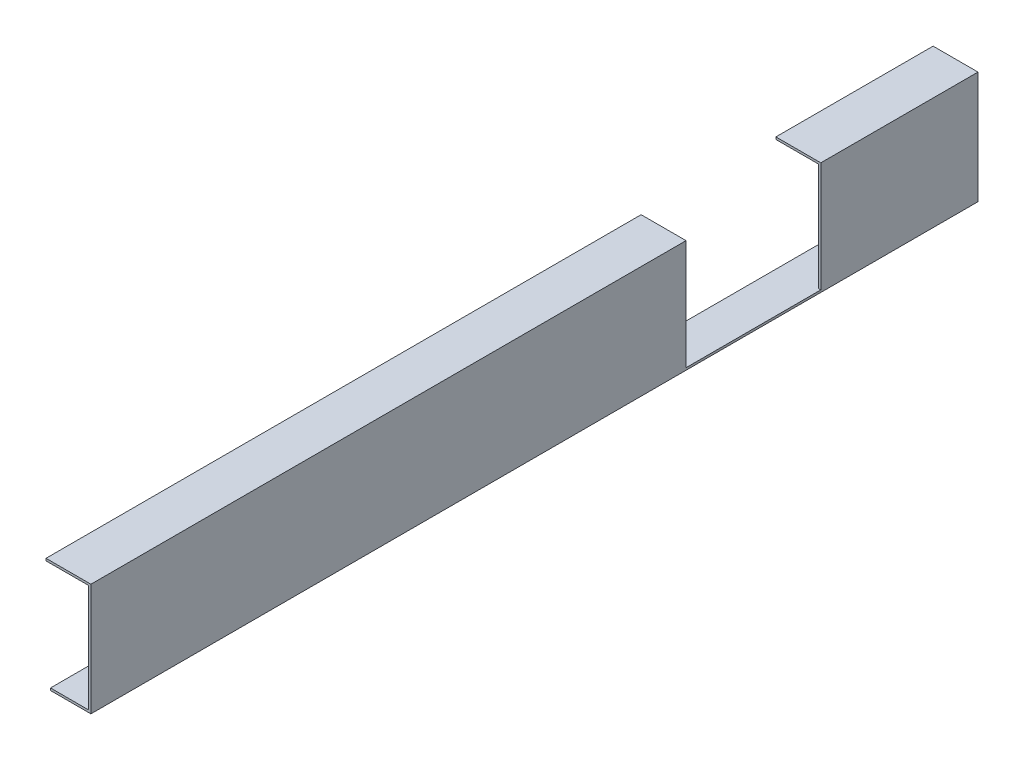
ISO-10303-21;
HEADER;
FILE_DESCRIPTION(('STEP AP214'),'2;1');
FILE_NAME('part.step','',(''),(''),'','','');
FILE_SCHEMA(('AUTOMOTIVE_DESIGN { 1 0 10303 214 1 1 1 1 }'));
ENDSEC;
DATA;
#1=APPLICATION_CONTEXT('core data for automotive mechanical design processes');
#2=APPLICATION_PROTOCOL_DEFINITION('international standard','automotive_design',2000,#1);
#3=PRODUCT_CONTEXT('',#1,'mechanical');
#4=PRODUCT('Part','Part','',(#3));
#5=PRODUCT_RELATED_PRODUCT_CATEGORY('part','',(#4));
#6=PRODUCT_DEFINITION_FORMATION('','',#4);
#7=PRODUCT_DEFINITION_CONTEXT('part definition',#1,'design');
#8=PRODUCT_DEFINITION('design','',#6,#7);
#9=PRODUCT_DEFINITION_SHAPE('','',#8);
#10=(LENGTH_UNIT() NAMED_UNIT(*) SI_UNIT(.MILLI.,.METRE.));
#11=(NAMED_UNIT(*) PLANE_ANGLE_UNIT() SI_UNIT($,.RADIAN.));
#12=(NAMED_UNIT(*) SI_UNIT($,.STERADIAN.) SOLID_ANGLE_UNIT());
#13=UNCERTAINTY_MEASURE_WITH_UNIT(LENGTH_MEASURE(1.E-05),#10,'distance_accuracy_value','');
#14=(GEOMETRIC_REPRESENTATION_CONTEXT(3) GLOBAL_UNCERTAINTY_ASSIGNED_CONTEXT((#13)) GLOBAL_UNIT_ASSIGNED_CONTEXT((#10,
#11,#12)) REPRESENTATION_CONTEXT('',''));
#15=CARTESIAN_POINT('',(0.,0.,0.));
#16=DIRECTION('',(0.,0.,1.));
#17=DIRECTION('',(1.,0.,0.));
#18=AXIS2_PLACEMENT_3D('',#15,#16,#17);
#19=CARTESIAN_POINT('',(-4.00000000000001,44.6666666666667,790.));
#20=DIRECTION('',(1.,0.,0.));
#21=DIRECTION('',(0.,0.,-1.));
#22=AXIS2_PLACEMENT_3D('',#19,#20,#21);
#23=PLANE('',#22);
#24=DIRECTION('',(0.,0.,-1.));
#25=VECTOR('',#24,1.);
#26=CARTESIAN_POINT('',(-4.00000000000001,46.6666666666667,790.));
#27=LINE('',#26,#25);
#28=CARTESIAN_POINT('',(-4.00000000000001,46.6666666666667,790.));
#29=VERTEX_POINT('',#28);
#30=CARTESIAN_POINT('',(-4.,46.6666666666667,260.));
#31=VERTEX_POINT('',#30);
#32=EDGE_CURVE('E171',#29,#31,#27,.T.);
#33=ORIENTED_EDGE('',*,*,#32,.T.);
#34=DIRECTION('',(0.,-1.,0.));
#35=VECTOR('',#34,1.);
#36=CARTESIAN_POINT('',(-4.00000000000001,44.6666666666667,260.));
#37=LINE('',#36,#35);
#38=CARTESIAN_POINT('',(-4.,44.6666666666667,260.));
#39=VERTEX_POINT('',#38);
#40=EDGE_CURVE('E154',#31,#39,#37,.T.);
#41=ORIENTED_EDGE('',*,*,#40,.T.);
#42=DIRECTION('',(0.,0.,-1.));
#43=VECTOR('',#42,1.);
#44=CARTESIAN_POINT('',(-4.00000000000001,44.6666666666667,790.));
#45=LINE('',#44,#43);
#46=CARTESIAN_POINT('',(-4.00000000000001,44.6666666666667,790.));
#47=VERTEX_POINT('',#46);
#48=EDGE_CURVE('E188',#47,#39,#45,.T.);
#49=ORIENTED_EDGE('',*,*,#48,.F.);
#50=DIRECTION('',(0.,-1.,0.));
#51=VECTOR('',#50,1.);
#52=CARTESIAN_POINT('',(-4.00000000000001,44.6666666666667,790.));
#53=LINE('',#52,#51);
#54=EDGE_CURVE('E170',#29,#47,#53,.T.);
#55=ORIENTED_EDGE('',*,*,#54,.F.);
#56=EDGE_LOOP('',(#33,#41,#49,#55));
#57=FACE_BOUND('',#56,.T.);
#58=ADVANCED_FACE('F38',(#57),#23,.F.);
#59=CARTESIAN_POINT('',(34.,44.6666666666667,790.));
#60=DIRECTION('',(0.,1.,0.));
#61=DIRECTION('',(0.,0.,1.));
#62=AXIS2_PLACEMENT_3D('',#59,#60,#61);
#63=PLANE('',#62);
#64=ORIENTED_EDGE('',*,*,#48,.T.);
#65=DIRECTION('',(1.,0.,0.));
#66=VECTOR('',#65,1.);
#67=CARTESIAN_POINT('',(34.,44.6666666666667,260.));
#68=LINE('',#67,#66);
#69=CARTESIAN_POINT('',(34.,44.6666666666667,260.));
#70=VERTEX_POINT('',#69);
#71=EDGE_CURVE('E225',#39,#70,#68,.T.);
#72=ORIENTED_EDGE('',*,*,#71,.T.);
#73=DIRECTION('',(0.,0.,-1.));
#74=VECTOR('',#73,1.);
#75=CARTESIAN_POINT('',(34.,44.6666666666667,790.));
#76=LINE('',#75,#74);
#77=CARTESIAN_POINT('',(34.,44.6666666666667,790.));
#78=VERTEX_POINT('',#77);
#79=EDGE_CURVE('E184',#78,#70,#76,.T.);
#80=ORIENTED_EDGE('',*,*,#79,.F.);
#81=DIRECTION('',(1.,0.,0.));
#82=VECTOR('',#81,1.);
#83=CARTESIAN_POINT('',(34.,44.6666666666667,790.));
#84=LINE('',#83,#82);
#85=EDGE_CURVE('E105',#47,#78,#84,.T.);
#86=ORIENTED_EDGE('',*,*,#85,.F.);
#87=EDGE_LOOP('',(#64,#72,#80,#86));
#88=FACE_BOUND('',#87,.T.);
#89=ADVANCED_FACE('F279',(#88),#63,.F.);
#90=CARTESIAN_POINT('',(34.,-51.3333333333333,790.));
#91=DIRECTION('',(1.,0.,0.));
#92=DIRECTION('',(0.,1.,0.));
#93=AXIS2_PLACEMENT_3D('',#90,#91,#92);
#94=PLANE('',#93);
#95=ORIENTED_EDGE('',*,*,#79,.T.);
#96=DIRECTION('',(0.,-1.,0.));
#97=VECTOR('',#96,1.);
#98=CARTESIAN_POINT('',(34.,-51.3333333333333,260.));
#99=LINE('',#98,#97);
#100=CARTESIAN_POINT('',(34.,-51.3333333333333,260.));
#101=VERTEX_POINT('',#100);
#102=EDGE_CURVE('E217',#70,#101,#99,.T.);
#103=ORIENTED_EDGE('',*,*,#102,.T.);
#104=DIRECTION('',(0.,0.,-1.));
#105=VECTOR('',#104,1.);
#106=CARTESIAN_POINT('',(34.,-51.3333333333333,790.));
#107=LINE('',#106,#105);
#108=CARTESIAN_POINT('',(34.,-51.3333333333333,790.));
#109=VERTEX_POINT('',#108);
#110=EDGE_CURVE('E180',#109,#101,#107,.T.);
#111=ORIENTED_EDGE('',*,*,#110,.F.);
#112=DIRECTION('',(0.,-1.,0.));
#113=VECTOR('',#112,1.);
#114=CARTESIAN_POINT('',(34.,-51.3333333333333,790.));
#115=LINE('',#114,#113);
#116=EDGE_CURVE('E232',#78,#109,#115,.T.);
#117=ORIENTED_EDGE('',*,*,#116,.F.);
#118=EDGE_LOOP('',(#95,#103,#111,#117));
#119=FACE_BOUND('',#118,.T.);
#120=ADVANCED_FACE('F283',(#119),#94,.F.);
#121=CARTESIAN_POINT('',(-4.00000000000001,46.6666666666667,790.));
#122=DIRECTION('',(0.,-1.,0.));
#123=DIRECTION('',(0.,0.,-1.));
#124=AXIS2_PLACEMENT_3D('',#121,#122,#123);
#125=PLANE('',#124);
#126=DIRECTION('',(0.,0.,-1.));
#127=VECTOR('',#126,1.);
#128=CARTESIAN_POINT('',(36.,46.6666666666667,790.));
#129=LINE('',#128,#127);
#130=CARTESIAN_POINT('',(36.,46.6666666666667,790.));
#131=VERTEX_POINT('',#130);
#132=CARTESIAN_POINT('',(36.,46.6666666666667,260.));
#133=VERTEX_POINT('',#132);
#134=EDGE_CURVE('E141',#131,#133,#129,.T.);
#135=ORIENTED_EDGE('',*,*,#134,.T.);
#136=DIRECTION('',(-1.,0.,0.));
#137=VECTOR('',#136,1.);
#138=CARTESIAN_POINT('',(-4.00000000000001,46.6666666666667,260.));
#139=LINE('',#138,#137);
#140=EDGE_CURVE('E11',#133,#31,#139,.T.);
#141=ORIENTED_EDGE('',*,*,#140,.T.);
#142=ORIENTED_EDGE('',*,*,#32,.F.);
#143=DIRECTION('',(-1.,0.,0.));
#144=VECTOR('',#143,1.);
#145=CARTESIAN_POINT('',(-4.00000000000001,46.6666666666667,790.));
#146=LINE('',#145,#144);
#147=EDGE_CURVE('E62',#131,#29,#146,.T.);
#148=ORIENTED_EDGE('',*,*,#147,.F.);
#149=EDGE_LOOP('',(#135,#141,#142,#148));
#150=FACE_BOUND('',#149,.T.);
#151=ADVANCED_FACE('F275',(#150),#125,.F.);
#152=CARTESIAN_POINT('',(-4.,44.6666666666667,140.));
#153=VERTEX_POINT('',#152);
#154=CARTESIAN_POINT('',(-4.00000000000001,44.6666666666667,0.));
#155=VERTEX_POINT('',#154);
#156=EDGE_CURVE('E187',#153,#155,#45,.T.);
#157=ORIENTED_EDGE('',*,*,#156,.F.);
#158=DIRECTION('',(0.,1.,0.));
#159=VECTOR('',#158,1.);
#160=CARTESIAN_POINT('',(-4.00000000000001,44.6666666666669,140.));
#161=LINE('',#160,#159);
#162=CARTESIAN_POINT('',(-4.,46.6666666666667,140.));
#163=VERTEX_POINT('',#162);
#164=EDGE_CURVE('E203',#153,#163,#161,.T.);
#165=ORIENTED_EDGE('',*,*,#164,.T.);
#166=CARTESIAN_POINT('',(-4.00000000000001,46.6666666666667,0.));
#167=VERTEX_POINT('',#166);
#168=EDGE_CURVE('E96',#163,#167,#27,.T.);
#169=ORIENTED_EDGE('',*,*,#168,.T.);
#170=DIRECTION('',(0.,-1.,0.));
#171=VECTOR('',#170,1.);
#172=CARTESIAN_POINT('',(-4.00000000000001,44.6666666666667,0.));
#173=LINE('',#172,#171);
#174=EDGE_CURVE('E151',#167,#155,#173,.T.);
#175=ORIENTED_EDGE('',*,*,#174,.T.);
#176=EDGE_LOOP('',(#157,#165,#169,#175));
#177=FACE_BOUND('',#176,.T.);
#178=ADVANCED_FACE('F40',(#177),#23,.F.);
#179=CARTESIAN_POINT('',(34.,44.6666666666667,140.));
#180=VERTEX_POINT('',#179);
#181=CARTESIAN_POINT('',(34.,44.6666666666667,0.));
#182=VERTEX_POINT('',#181);
#183=EDGE_CURVE('E183',#180,#182,#76,.T.);
#184=ORIENTED_EDGE('',*,*,#183,.F.);
#185=DIRECTION('',(-1.,0.,0.));
#186=VECTOR('',#185,1.);
#187=CARTESIAN_POINT('',(34.,44.6666666666667,140.));
#188=LINE('',#187,#186);
#189=EDGE_CURVE('E212',#180,#153,#188,.T.);
#190=ORIENTED_EDGE('',*,*,#189,.T.);
#191=ORIENTED_EDGE('',*,*,#156,.T.);
#192=DIRECTION('',(1.,0.,0.));
#193=VECTOR('',#192,1.);
#194=CARTESIAN_POINT('',(34.,44.6666666666667,0.));
#195=LINE('',#194,#193);
#196=EDGE_CURVE('E153',#155,#182,#195,.T.);
#197=ORIENTED_EDGE('',*,*,#196,.T.);
#198=EDGE_LOOP('',(#184,#190,#191,#197));
#199=FACE_BOUND('',#198,.T.);
#200=ADVANCED_FACE('F210',(#199),#63,.F.);
#201=CARTESIAN_POINT('',(34.,-51.3333333333333,140.));
#202=VERTEX_POINT('',#201);
#203=CARTESIAN_POINT('',(34.,-51.3333333333333,0.));
#204=VERTEX_POINT('',#203);
#205=EDGE_CURVE('E179',#202,#204,#107,.T.);
#206=ORIENTED_EDGE('',*,*,#205,.F.);
#207=DIRECTION('',(0.,1.,0.));
#208=VECTOR('',#207,1.);
#209=CARTESIAN_POINT('',(34.,-51.3333333333331,140.));
#210=LINE('',#209,#208);
#211=EDGE_CURVE('E215',#202,#180,#210,.T.);
#212=ORIENTED_EDGE('',*,*,#211,.T.);
#213=ORIENTED_EDGE('',*,*,#183,.T.);
#214=DIRECTION('',(0.,-1.,0.));
#215=VECTOR('',#214,1.);
#216=CARTESIAN_POINT('',(34.,-51.3333333333333,0.));
#217=LINE('',#216,#215);
#218=EDGE_CURVE('E157',#182,#204,#217,.T.);
#219=ORIENTED_EDGE('',*,*,#218,.T.);
#220=EDGE_LOOP('',(#206,#212,#213,#219));
#221=FACE_BOUND('',#220,.T.);
#222=ADVANCED_FACE('F247',(#221),#94,.F.);
#223=CARTESIAN_POINT('',(0.,-51.3333333333333,790.));
#224=DIRECTION('',(0.,-1.,0.));
#225=DIRECTION('',(0.,0.,-1.));
#226=AXIS2_PLACEMENT_3D('',#223,#224,#225);
#227=PLANE('',#226);
#228=DIRECTION('',(-1.,0.,0.));
#229=VECTOR('',#228,1.);
#230=CARTESIAN_POINT('',(0.,-51.3333333333333,0.));
#231=LINE('',#230,#229);
#232=CARTESIAN_POINT('',(0.,-51.3333333333333,0.));
#233=VERTEX_POINT('',#232);
#234=EDGE_CURVE('E160',#204,#233,#231,.T.);
#235=ORIENTED_EDGE('',*,*,#234,.T.);
#236=DIRECTION('',(0.,0.,-1.));
#237=VECTOR('',#236,1.);
#238=CARTESIAN_POINT('',(0.,-51.3333333333333,790.));
#239=LINE('',#238,#237);
#240=CARTESIAN_POINT('',(0.,-51.3333333333333,790.));
#241=VERTEX_POINT('',#240);
#242=EDGE_CURVE('E177',#241,#233,#239,.T.);
#243=ORIENTED_EDGE('',*,*,#242,.F.);
#244=DIRECTION('',(-1.,0.,0.));
#245=VECTOR('',#244,1.);
#246=CARTESIAN_POINT('',(0.,-51.3333333333333,790.));
#247=LINE('',#246,#245);
#248=EDGE_CURVE('E234',#109,#241,#247,.T.);
#249=ORIENTED_EDGE('',*,*,#248,.F.);
#250=ORIENTED_EDGE('',*,*,#110,.T.);
#251=DIRECTION('',(1.,0.,0.));
#252=VECTOR('',#251,1.);
#253=CARTESIAN_POINT('',(-188.,-51.3333333333333,260.));
#254=LINE('',#253,#252);
#255=CARTESIAN_POINT('',(36.,-51.3333333333333,260.));
#256=VERTEX_POINT('',#255);
#257=EDGE_CURVE('E257',#101,#256,#254,.T.);
#258=ORIENTED_EDGE('',*,*,#257,.T.);
#259=DIRECTION('',(0.,0.,-1.));
#260=VECTOR('',#259,1.);
#261=CARTESIAN_POINT('',(36.,-51.3333333333333,260.));
#262=LINE('',#261,#260);
#263=CARTESIAN_POINT('',(36.,-51.3333333333333,140.));
#264=VERTEX_POINT('',#263);
#265=EDGE_CURVE('E256',#256,#264,#262,.T.);
#266=ORIENTED_EDGE('',*,*,#265,.T.);
#267=DIRECTION('',(1.,0.,0.));
#268=VECTOR('',#267,1.);
#269=CARTESIAN_POINT('',(-188.,-51.3333333333333,140.));
#270=LINE('',#269,#268);
#271=EDGE_CURVE('E219',#202,#264,#270,.T.);
#272=ORIENTED_EDGE('',*,*,#271,.F.);
#273=ORIENTED_EDGE('',*,*,#205,.T.);
#274=EDGE_LOOP('',(#235,#243,#249,#250,#258,#266,#272,#273));
#275=FACE_BOUND('',#274,.T.);
#276=ADVANCED_FACE('F240',(#275),#227,.F.);
#277=CARTESIAN_POINT('',(0.,-53.3333333333333,790.));
#278=DIRECTION('',(1.,0.,0.));
#279=DIRECTION('',(0.,1.,0.));
#280=AXIS2_PLACEMENT_3D('',#277,#278,#279);
#281=PLANE('',#280);
#282=DIRECTION('',(0.,-1.,0.));
#283=VECTOR('',#282,1.);
#284=CARTESIAN_POINT('',(0.,-53.3333333333333,0.));
#285=LINE('',#284,#283);
#286=CARTESIAN_POINT('',(0.,-53.3333333333333,0.));
#287=VERTEX_POINT('',#286);
#288=EDGE_CURVE('E163',#233,#287,#285,.T.);
#289=ORIENTED_EDGE('',*,*,#288,.T.);
#290=DIRECTION('',(0.,0.,-1.));
#291=VECTOR('',#290,1.);
#292=CARTESIAN_POINT('',(0.,-53.3333333333333,790.));
#293=LINE('',#292,#291);
#294=CARTESIAN_POINT('',(0.,-53.3333333333333,790.));
#295=VERTEX_POINT('',#294);
#296=EDGE_CURVE('E140',#295,#287,#293,.T.);
#297=ORIENTED_EDGE('',*,*,#296,.F.);
#298=DIRECTION('',(0.,-1.,0.));
#299=VECTOR('',#298,1.);
#300=CARTESIAN_POINT('',(0.,-53.3333333333333,790.));
#301=LINE('',#300,#299);
#302=EDGE_CURVE('E127',#241,#295,#301,.T.);
#303=ORIENTED_EDGE('',*,*,#302,.F.);
#304=ORIENTED_EDGE('',*,*,#242,.T.);
#305=EDGE_LOOP('',(#289,#297,#303,#304));
#306=FACE_BOUND('',#305,.T.);
#307=ADVANCED_FACE('F244',(#306),#281,.F.);
#308=CARTESIAN_POINT('',(36.,-53.3333333333333,790.));
#309=DIRECTION('',(0.,1.,0.));
#310=DIRECTION('',(0.,0.,1.));
#311=AXIS2_PLACEMENT_3D('',#308,#309,#310);
#312=PLANE('',#311);
#313=DIRECTION('',(1.,0.,0.));
#314=VECTOR('',#313,1.);
#315=CARTESIAN_POINT('',(36.,-53.3333333333333,0.));
#316=LINE('',#315,#314);
#317=CARTESIAN_POINT('',(36.,-53.3333333333333,0.));
#318=VERTEX_POINT('',#317);
#319=EDGE_CURVE('E136',#287,#318,#316,.T.);
#320=ORIENTED_EDGE('',*,*,#319,.T.);
#321=DIRECTION('',(0.,0.,-1.));
#322=VECTOR('',#321,1.);
#323=CARTESIAN_POINT('',(36.,-53.3333333333333,790.));
#324=LINE('',#323,#322);
#325=CARTESIAN_POINT('',(36.,-53.3333333333333,790.));
#326=VERTEX_POINT('',#325);
#327=EDGE_CURVE('E133',#326,#318,#324,.T.);
#328=ORIENTED_EDGE('',*,*,#327,.F.);
#329=DIRECTION('',(1.,0.,0.));
#330=VECTOR('',#329,1.);
#331=CARTESIAN_POINT('',(36.,-53.3333333333333,790.));
#332=LINE('',#331,#330);
#333=EDGE_CURVE('E120',#295,#326,#332,.T.);
#334=ORIENTED_EDGE('',*,*,#333,.F.);
#335=ORIENTED_EDGE('',*,*,#296,.T.);
#336=EDGE_LOOP('',(#320,#328,#334,#335));
#337=FACE_BOUND('',#336,.T.);
#338=ADVANCED_FACE('F134',(#337),#312,.F.);
#339=CARTESIAN_POINT('',(36.,46.6666666666667,790.));
#340=DIRECTION('',(-1.,0.,0.));
#341=DIRECTION('',(0.,-1.,0.));
#342=AXIS2_PLACEMENT_3D('',#339,#340,#341);
#343=PLANE('',#342);
#344=ORIENTED_EDGE('',*,*,#265,.F.);
#345=DIRECTION('',(0.,-1.,0.));
#346=VECTOR('',#345,1.);
#347=CARTESIAN_POINT('',(36.,46.6666666666667,260.));
#348=LINE('',#347,#346);
#349=EDGE_CURVE('E262',#133,#256,#348,.T.);
#350=ORIENTED_EDGE('',*,*,#349,.F.);
#351=ORIENTED_EDGE('',*,*,#134,.F.);
#352=DIRECTION('',(0.,1.,0.));
#353=VECTOR('',#352,1.);
#354=CARTESIAN_POINT('',(36.,46.6666666666667,790.));
#355=LINE('',#354,#353);
#356=EDGE_CURVE('E124',#326,#131,#355,.T.);
#357=ORIENTED_EDGE('',*,*,#356,.F.);
#358=ORIENTED_EDGE('',*,*,#327,.T.);
#359=DIRECTION('',(0.,1.,0.));
#360=VECTOR('',#359,1.);
#361=CARTESIAN_POINT('',(36.,46.6666666666667,0.));
#362=LINE('',#361,#360);
#363=CARTESIAN_POINT('',(36.,46.6666666666667,0.));
#364=VERTEX_POINT('',#363);
#365=EDGE_CURVE('E166',#318,#364,#362,.T.);
#366=ORIENTED_EDGE('',*,*,#365,.T.);
#367=CARTESIAN_POINT('',(36.,46.6666666666667,140.));
#368=VERTEX_POINT('',#367);
#369=EDGE_CURVE('E174',#368,#364,#129,.T.);
#370=ORIENTED_EDGE('',*,*,#369,.F.);
#371=DIRECTION('',(0.,1.,0.));
#372=VECTOR('',#371,1.);
#373=CARTESIAN_POINT('',(36.,46.6666666666667,140.));
#374=LINE('',#373,#372);
#375=EDGE_CURVE('E53',#264,#368,#374,.T.);
#376=ORIENTED_EDGE('',*,*,#375,.F.);
#377=EDGE_LOOP('',(#344,#350,#351,#357,#358,#366,#370,#376));
#378=FACE_BOUND('',#377,.T.);
#379=ADVANCED_FACE('F144',(#378),#343,.F.);
#380=ORIENTED_EDGE('',*,*,#168,.F.);
#381=DIRECTION('',(1.,0.,0.));
#382=VECTOR('',#381,1.);
#383=CARTESIAN_POINT('',(-4.00000000000001,46.6666666666667,140.));
#384=LINE('',#383,#382);
#385=EDGE_CURVE('E46',#163,#368,#384,.T.);
#386=ORIENTED_EDGE('',*,*,#385,.T.);
#387=ORIENTED_EDGE('',*,*,#369,.T.);
#388=DIRECTION('',(-1.,0.,0.));
#389=VECTOR('',#388,1.);
#390=CARTESIAN_POINT('',(-4.00000000000001,46.6666666666667,0.));
#391=LINE('',#390,#389);
#392=EDGE_CURVE('E168',#364,#167,#391,.T.);
#393=ORIENTED_EDGE('',*,*,#392,.T.);
#394=EDGE_LOOP('',(#380,#386,#387,#393));
#395=FACE_BOUND('',#394,.T.);
#396=ADVANCED_FACE('F191',(#395),#125,.F.);
#397=CARTESIAN_POINT('',(0.,0.,790.));
#398=DIRECTION('',(0.,0.,-1.));
#399=DIRECTION('',(-1.,0.,0.));
#400=AXIS2_PLACEMENT_3D('',#397,#398,#399);
#401=PLANE('',#400);
#402=ORIENTED_EDGE('',*,*,#54,.T.);
#403=ORIENTED_EDGE('',*,*,#85,.T.);
#404=ORIENTED_EDGE('',*,*,#116,.T.);
#405=ORIENTED_EDGE('',*,*,#248,.T.);
#406=ORIENTED_EDGE('',*,*,#302,.T.);
#407=ORIENTED_EDGE('',*,*,#333,.T.);
#408=ORIENTED_EDGE('',*,*,#356,.T.);
#409=ORIENTED_EDGE('',*,*,#147,.T.);
#410=EDGE_LOOP('',(#402,#403,#404,#405,#406,#407,#408,#409));
#411=FACE_BOUND('',#410,.T.);
#412=ADVANCED_FACE('F122',(#411),#401,.F.);
#413=CARTESIAN_POINT('',(0.,0.,0.));
#414=DIRECTION('',(0.,0.,-1.));
#415=DIRECTION('',(-1.,0.,0.));
#416=AXIS2_PLACEMENT_3D('',#413,#414,#415);
#417=PLANE('',#416);
#418=ORIENTED_EDGE('',*,*,#174,.F.);
#419=ORIENTED_EDGE('',*,*,#392,.F.);
#420=ORIENTED_EDGE('',*,*,#365,.F.);
#421=ORIENTED_EDGE('',*,*,#319,.F.);
#422=ORIENTED_EDGE('',*,*,#288,.F.);
#423=ORIENTED_EDGE('',*,*,#234,.F.);
#424=ORIENTED_EDGE('',*,*,#218,.F.);
#425=ORIENTED_EDGE('',*,*,#196,.F.);
#426=EDGE_LOOP('',(#418,#419,#420,#421,#422,#423,#424,#425));
#427=FACE_BOUND('',#426,.T.);
#428=ADVANCED_FACE('F198',(#427),#417,.T.);
#429=CARTESIAN_POINT('',(-188.,46.6666666666667,260.));
#430=DIRECTION('',(0.,0.,1.));
#431=DIRECTION('',(1.,0.,0.));
#432=AXIS2_PLACEMENT_3D('',#429,#430,#431);
#433=PLANE('',#432);
#434=ORIENTED_EDGE('',*,*,#140,.F.);
#435=ORIENTED_EDGE('',*,*,#349,.T.);
#436=ORIENTED_EDGE('',*,*,#257,.F.);
#437=ORIENTED_EDGE('',*,*,#102,.F.);
#438=ORIENTED_EDGE('',*,*,#71,.F.);
#439=ORIENTED_EDGE('',*,*,#40,.F.);
#440=EDGE_LOOP('',(#434,#435,#436,#437,#438,#439));
#441=FACE_BOUND('',#440,.T.);
#442=ADVANCED_FACE('F268',(#441),#433,.F.);
#443=CARTESIAN_POINT('',(-188.,46.6666666666667,140.));
#444=DIRECTION('',(0.,0.,-1.));
#445=DIRECTION('',(0.,1.,0.));
#446=AXIS2_PLACEMENT_3D('',#443,#444,#445);
#447=PLANE('',#446);
#448=ORIENTED_EDGE('',*,*,#189,.F.);
#449=ORIENTED_EDGE('',*,*,#211,.F.);
#450=ORIENTED_EDGE('',*,*,#271,.T.);
#451=ORIENTED_EDGE('',*,*,#375,.T.);
#452=ORIENTED_EDGE('',*,*,#385,.F.);
#453=ORIENTED_EDGE('',*,*,#164,.F.);
#454=EDGE_LOOP('',(#448,#449,#450,#451,#452,#453));
#455=FACE_BOUND('',#454,.T.);
#456=ADVANCED_FACE('F251',(#455),#447,.F.);
#457=CLOSED_SHELL('',(#58,#89,#120,#151,#178,#200,#222,#276,#307,#338,#379,#396,#412,#428,#442,#456));
#458=MANIFOLD_SOLID_BREP('B2',#457);
#459=ADVANCED_BREP_SHAPE_REPRESENTATION('',(#18,#458),#14);
#460=SHAPE_DEFINITION_REPRESENTATION(#9,#459);
ENDSEC;
END-ISO-10303-21;
